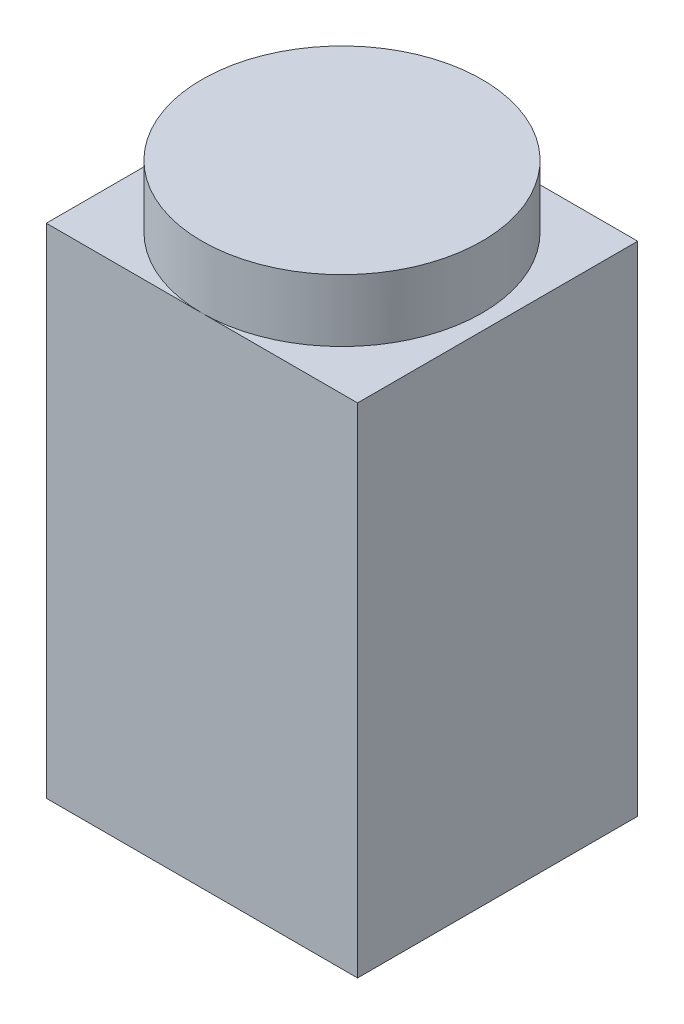
ISO-10303-21;
HEADER;
FILE_DESCRIPTION(('STEP AP214'),'2;1');
FILE_NAME('part.step','',(''),(''),'','','');
FILE_SCHEMA(('AUTOMOTIVE_DESIGN { 1 0 10303 214 1 1 1 1 }'));
ENDSEC;
DATA;
#1=APPLICATION_CONTEXT('core data for automotive mechanical design processes');
#2=APPLICATION_PROTOCOL_DEFINITION('international standard','automotive_design',2000,#1);
#3=PRODUCT_CONTEXT('',#1,'mechanical');
#4=PRODUCT('Part','Part','',(#3));
#5=PRODUCT_RELATED_PRODUCT_CATEGORY('part','',(#4));
#6=PRODUCT_DEFINITION_FORMATION('','',#4);
#7=PRODUCT_DEFINITION_CONTEXT('part definition',#1,'design');
#8=PRODUCT_DEFINITION('design','',#6,#7);
#9=PRODUCT_DEFINITION_SHAPE('','',#8);
#10=(LENGTH_UNIT() NAMED_UNIT(*) SI_UNIT(.MILLI.,.METRE.));
#11=(NAMED_UNIT(*) PLANE_ANGLE_UNIT() SI_UNIT($,.RADIAN.));
#12=(NAMED_UNIT(*) SI_UNIT($,.STERADIAN.) SOLID_ANGLE_UNIT());
#13=UNCERTAINTY_MEASURE_WITH_UNIT(LENGTH_MEASURE(1.E-05),#10,'distance_accuracy_value','');
#14=(GEOMETRIC_REPRESENTATION_CONTEXT(3) GLOBAL_UNCERTAINTY_ASSIGNED_CONTEXT((#13)) GLOBAL_UNIT_ASSIGNED_CONTEXT((#10,
#11,#12)) REPRESENTATION_CONTEXT('',''));
#15=CARTESIAN_POINT('',(0.,0.,0.));
#16=DIRECTION('',(0.,0.,1.));
#17=DIRECTION('',(1.,0.,0.));
#18=AXIS2_PLACEMENT_3D('',#15,#16,#17);
#19=CARTESIAN_POINT('',(-25.,45.,-22.5));
#20=DIRECTION('',(1.,0.,0.));
#21=DIRECTION('',(0.,0.,-1.));
#22=AXIS2_PLACEMENT_3D('',#19,#20,#21);
#23=PLANE('',#22);
#24=DIRECTION('',(0.,0.,1.));
#25=VECTOR('',#24,1.);
#26=CARTESIAN_POINT('',(-25.,35.,-22.5));
#27=LINE('',#26,#25);
#28=CARTESIAN_POINT('',(-25.,35.,-22.5));
#29=VERTEX_POINT('',#28);
#30=CARTESIAN_POINT('',(-25.,35.,22.5));
#31=VERTEX_POINT('',#30);
#32=EDGE_CURVE('E89',#29,#31,#27,.T.);
#33=ORIENTED_EDGE('',*,*,#32,.F.);
#34=DIRECTION('',(0.,-1.,0.));
#35=VECTOR('',#34,1.);
#36=CARTESIAN_POINT('',(-25.,45.,-22.5));
#37=LINE('',#36,#35);
#38=CARTESIAN_POINT('',(-25.,-45.,-22.5));
#39=VERTEX_POINT('',#38);
#40=EDGE_CURVE('E59',#29,#39,#37,.T.);
#41=ORIENTED_EDGE('',*,*,#40,.T.);
#42=DIRECTION('',(0.,0.,1.));
#43=VECTOR('',#42,1.);
#44=CARTESIAN_POINT('',(-25.,-45.,-22.5));
#45=LINE('',#44,#43);
#46=CARTESIAN_POINT('',(-25.,-45.,22.5));
#47=VERTEX_POINT('',#46);
#48=EDGE_CURVE('E110',#39,#47,#45,.T.);
#49=ORIENTED_EDGE('',*,*,#48,.T.);
#50=DIRECTION('',(0.,-1.,0.));
#51=VECTOR('',#50,1.);
#52=CARTESIAN_POINT('',(-25.,45.,22.5));
#53=LINE('',#52,#51);
#54=EDGE_CURVE('E123',#31,#47,#53,.T.);
#55=ORIENTED_EDGE('',*,*,#54,.F.);
#56=EDGE_LOOP('',(#33,#41,#49,#55));
#57=FACE_BOUND('',#56,.T.);
#58=ADVANCED_FACE('F38',(#57),#23,.F.);
#59=CARTESIAN_POINT('',(-25.,45.,22.5));
#60=DIRECTION('',(0.,0.,-1.));
#61=DIRECTION('',(-1.,0.,0.));
#62=AXIS2_PLACEMENT_3D('',#59,#60,#61);
#63=PLANE('',#62);
#64=DIRECTION('',(1.,0.,0.));
#65=VECTOR('',#64,1.);
#66=CARTESIAN_POINT('',(-25.,35.,22.5));
#67=LINE('',#66,#65);
#68=CARTESIAN_POINT('',(0.,35.,22.5));
#69=VERTEX_POINT('',#68);
#70=EDGE_CURVE('E86',#31,#69,#67,.T.);
#71=ORIENTED_EDGE('',*,*,#70,.F.);
#72=ORIENTED_EDGE('',*,*,#54,.T.);
#73=DIRECTION('',(1.,0.,0.));
#74=VECTOR('',#73,1.);
#75=CARTESIAN_POINT('',(-25.,-45.,22.5));
#76=LINE('',#75,#74);
#77=CARTESIAN_POINT('',(25.,-45.,22.5));
#78=VERTEX_POINT('',#77);
#79=EDGE_CURVE('E112',#47,#78,#76,.T.);
#80=ORIENTED_EDGE('',*,*,#79,.T.);
#81=DIRECTION('',(0.,-1.,0.));
#82=VECTOR('',#81,1.);
#83=CARTESIAN_POINT('',(25.,45.,22.5));
#84=LINE('',#83,#82);
#85=CARTESIAN_POINT('',(25.,35.,22.5));
#86=VERTEX_POINT('',#85);
#87=EDGE_CURVE('E106',#86,#78,#84,.T.);
#88=ORIENTED_EDGE('',*,*,#87,.F.);
#89=EDGE_CURVE('E93',#69,#86,#67,.T.);
#90=ORIENTED_EDGE('',*,*,#89,.F.);
#91=EDGE_LOOP('',(#71,#72,#80,#88,#90));
#92=FACE_BOUND('',#91,.T.);
#93=ADVANCED_FACE('F104',(#92),#63,.F.);
#94=CARTESIAN_POINT('',(25.,45.,-22.5));
#95=DIRECTION('',(-1.,0.,0.));
#96=DIRECTION('',(0.,0.,1.));
#97=AXIS2_PLACEMENT_3D('',#94,#95,#96);
#98=PLANE('',#97);
#99=DIRECTION('',(0.,0.,-1.));
#100=VECTOR('',#99,1.);
#101=CARTESIAN_POINT('',(25.,35.,-22.5));
#102=LINE('',#101,#100);
#103=CARTESIAN_POINT('',(25.,35.,-22.5));
#104=VERTEX_POINT('',#103);
#105=EDGE_CURVE('E102',#86,#104,#102,.T.);
#106=ORIENTED_EDGE('',*,*,#105,.F.);
#107=ORIENTED_EDGE('',*,*,#87,.T.);
#108=DIRECTION('',(0.,0.,-1.));
#109=VECTOR('',#108,1.);
#110=CARTESIAN_POINT('',(25.,-45.,-22.5));
#111=LINE('',#110,#109);
#112=CARTESIAN_POINT('',(25.,-45.,-22.5));
#113=VERTEX_POINT('',#112);
#114=EDGE_CURVE('E114',#78,#113,#111,.T.);
#115=ORIENTED_EDGE('',*,*,#114,.T.);
#116=DIRECTION('',(0.,-1.,0.));
#117=VECTOR('',#116,1.);
#118=CARTESIAN_POINT('',(25.,45.,-22.5));
#119=LINE('',#118,#117);
#120=EDGE_CURVE('E120',#104,#113,#119,.T.);
#121=ORIENTED_EDGE('',*,*,#120,.F.);
#122=EDGE_LOOP('',(#106,#107,#115,#121));
#123=FACE_BOUND('',#122,.T.);
#124=ADVANCED_FACE('F138',(#123),#98,.F.);
#125=CARTESIAN_POINT('',(-25.,45.,-22.5));
#126=DIRECTION('',(0.,0.,1.));
#127=DIRECTION('',(1.,0.,0.));
#128=AXIS2_PLACEMENT_3D('',#125,#126,#127);
#129=PLANE('',#128);
#130=DIRECTION('',(-1.,0.,0.));
#131=VECTOR('',#130,1.);
#132=CARTESIAN_POINT('',(-25.,35.,-22.5));
#133=LINE('',#132,#131);
#134=CARTESIAN_POINT('',(0.,35.,-22.5));
#135=VERTEX_POINT('',#134);
#136=EDGE_CURVE('E12',#104,#135,#133,.T.);
#137=ORIENTED_EDGE('',*,*,#136,.F.);
#138=ORIENTED_EDGE('',*,*,#120,.T.);
#139=DIRECTION('',(-1.,0.,0.));
#140=VECTOR('',#139,1.);
#141=CARTESIAN_POINT('',(-25.,-45.,-22.5));
#142=LINE('',#141,#140);
#143=EDGE_CURVE('E117',#113,#39,#142,.T.);
#144=ORIENTED_EDGE('',*,*,#143,.T.);
#145=ORIENTED_EDGE('',*,*,#40,.F.);
#146=EDGE_CURVE('E41',#135,#29,#133,.T.);
#147=ORIENTED_EDGE('',*,*,#146,.F.);
#148=EDGE_LOOP('',(#137,#138,#144,#145,#147));
#149=FACE_BOUND('',#148,.T.);
#150=ADVANCED_FACE('F129',(#149),#129,.F.);
#151=CARTESIAN_POINT('',(0.,-45.,0.));
#152=DIRECTION('',(0.,1.,0.));
#153=DIRECTION('',(0.,0.,1.));
#154=AXIS2_PLACEMENT_3D('',#151,#152,#153);
#155=PLANE('',#154);
#156=ORIENTED_EDGE('',*,*,#48,.F.);
#157=ORIENTED_EDGE('',*,*,#143,.F.);
#158=ORIENTED_EDGE('',*,*,#114,.F.);
#159=ORIENTED_EDGE('',*,*,#79,.F.);
#160=EDGE_LOOP('',(#156,#157,#158,#159));
#161=FACE_BOUND('',#160,.T.);
#162=ADVANCED_FACE('F136',(#161),#155,.F.);
#163=CARTESIAN_POINT('',(0.,35.,0.));
#164=DIRECTION('',(0.,1.,0.));
#165=DIRECTION('',(0.,0.,1.));
#166=AXIS2_PLACEMENT_3D('',#163,#164,#165);
#167=PLANE('',#166);
#168=ORIENTED_EDGE('',*,*,#32,.T.);
#169=ORIENTED_EDGE('',*,*,#70,.T.);
#170=CARTESIAN_POINT('',(0.,35.,0.));
#171=DIRECTION('',(0.,1.,0.));
#172=DIRECTION('',(0.,0.,1.));
#173=AXIS2_PLACEMENT_3D('',#170,#171,#172);
#174=CIRCLE('',#173,22.5);
#175=EDGE_CURVE('E88',#135,#69,#174,.T.);
#176=ORIENTED_EDGE('',*,*,#175,.F.);
#177=ORIENTED_EDGE('',*,*,#146,.T.);
#178=EDGE_LOOP('',(#168,#169,#176,#177));
#179=FACE_BOUND('',#178,.T.);
#180=ADVANCED_FACE('F87',(#179),#167,.T.);
#181=ORIENTED_EDGE('',*,*,#89,.T.);
#182=ORIENTED_EDGE('',*,*,#105,.T.);
#183=ORIENTED_EDGE('',*,*,#136,.T.);
#184=EDGE_CURVE('E51',#69,#135,#174,.T.);
#185=ORIENTED_EDGE('',*,*,#184,.F.);
#186=EDGE_LOOP('',(#181,#182,#183,#185));
#187=FACE_BOUND('',#186,.T.);
#188=ADVANCED_FACE('F98',(#187),#167,.T.);
#189=CARTESIAN_POINT('',(0.,35.,0.));
#190=DIRECTION('',(0.,1.,0.));
#191=DIRECTION('',(0.,0.,1.));
#192=AXIS2_PLACEMENT_3D('',#189,#190,#191);
#193=CYLINDRICAL_SURFACE('',#192,22.5);
#194=CARTESIAN_POINT('',(0.,45.,0.));
#195=DIRECTION('',(0.,1.,0.));
#196=DIRECTION('',(0.,0.,1.));
#197=AXIS2_PLACEMENT_3D('',#194,#195,#196);
#198=CIRCLE('',#197,22.5);
#199=CARTESIAN_POINT('',(0.,45.,22.5));
#200=VERTEX_POINT('',#199);
#201=EDGE_CURVE('E124',#200,#200,#198,.T.);
#202=ORIENTED_EDGE('',*,*,#201,.F.);
#203=EDGE_LOOP('',(#202));
#204=FACE_BOUND('',#203,.T.);
#205=ORIENTED_EDGE('',*,*,#175,.T.);
#206=ORIENTED_EDGE('',*,*,#184,.T.);
#207=EDGE_LOOP('',(#205,#206));
#208=FACE_BOUND('',#207,.T.);
#209=ADVANCED_FACE('F95',(#204,#208),#193,.T.);
#210=CARTESIAN_POINT('',(0.,45.,0.));
#211=DIRECTION('',(0.,1.,0.));
#212=DIRECTION('',(0.,0.,1.));
#213=AXIS2_PLACEMENT_3D('',#210,#211,#212);
#214=PLANE('',#213);
#215=ORIENTED_EDGE('',*,*,#201,.T.);
#216=EDGE_LOOP('',(#215));
#217=FACE_BOUND('',#216,.T.);
#218=ADVANCED_FACE('F190',(#217),#214,.T.);
#219=CLOSED_SHELL('',(#58,#93,#124,#150,#162,#180,#188,#209,#218));
#220=MANIFOLD_SOLID_BREP('B2',#219);
#221=ADVANCED_BREP_SHAPE_REPRESENTATION('',(#18,#220),#14);
#222=SHAPE_DEFINITION_REPRESENTATION(#9,#221);
ENDSEC;
END-ISO-10303-21;
